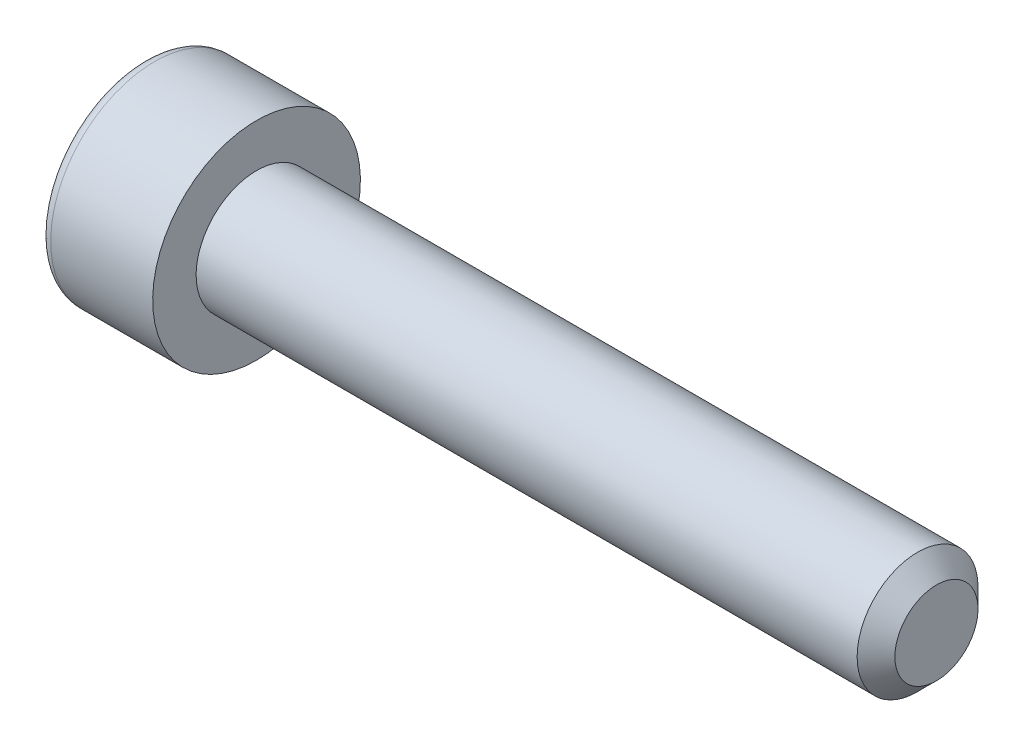
ISO-10303-21;
HEADER;
FILE_DESCRIPTION(('STEP AP214'),'2;1');
FILE_NAME('part.step','',(''),(''),'','','');
FILE_SCHEMA(('AUTOMOTIVE_DESIGN { 1 0 10303 214 1 1 1 1 }'));
ENDSEC;
DATA;
#1=APPLICATION_CONTEXT('core data for automotive mechanical design processes');
#2=APPLICATION_PROTOCOL_DEFINITION('international standard','automotive_design',2000,#1);
#3=PRODUCT_CONTEXT('',#1,'mechanical');
#4=PRODUCT('Part','Part','',(#3));
#5=PRODUCT_RELATED_PRODUCT_CATEGORY('part','',(#4));
#6=PRODUCT_DEFINITION_FORMATION('','',#4);
#7=PRODUCT_DEFINITION_CONTEXT('part definition',#1,'design');
#8=PRODUCT_DEFINITION('design','',#6,#7);
#9=PRODUCT_DEFINITION_SHAPE('','',#8);
#10=(LENGTH_UNIT() NAMED_UNIT(*) SI_UNIT(.MILLI.,.METRE.));
#11=(NAMED_UNIT(*) PLANE_ANGLE_UNIT() SI_UNIT($,.RADIAN.));
#12=(NAMED_UNIT(*) SI_UNIT($,.STERADIAN.) SOLID_ANGLE_UNIT());
#13=UNCERTAINTY_MEASURE_WITH_UNIT(LENGTH_MEASURE(1.E-05),#10,'distance_accuracy_value','');
#14=(GEOMETRIC_REPRESENTATION_CONTEXT(3) GLOBAL_UNCERTAINTY_ASSIGNED_CONTEXT((#13)) GLOBAL_UNIT_ASSIGNED_CONTEXT((#10,
#11,#12)) REPRESENTATION_CONTEXT('',''));
#15=CARTESIAN_POINT('',(0.,0.,0.));
#16=DIRECTION('',(0.,0.,1.));
#17=DIRECTION('',(1.,0.,0.));
#18=AXIS2_PLACEMENT_3D('',#15,#16,#17);
#19=CARTESIAN_POINT('',(-1.70000000002801,0.,0.));
#20=DIRECTION('',(-1.,0.,0.));
#21=DIRECTION('',(0.,0.,1.));
#22=AXIS2_PLACEMENT_3D('',#19,#20,#21);
#23=CONICAL_SURFACE('',#22,1.43650000001117,1.04719755119831);
#24=CARTESIAN_POINT('',(-0.870636338333952,0.,0.));
#25=VERTEX_POINT('',#24);
#26=VERTEX_LOOP('',#25);
#27=FACE_BOUND('',#26,.T.);
#28=CARTESIAN_POINT('',(-1.69999999996238,0.,0.));
#29=DIRECTION('',(-1.,0.,0.));
#30=DIRECTION('',(0.,0.,1.));
#31=AXIS2_PLACEMENT_3D('',#28,#29,#30);
#32=CIRCLE('',#31,1.43649999989748);
#33=CARTESIAN_POINT('',(-1.69999999996238,-0.718249999948738,-1.24404549244756));
#34=VERTEX_POINT('',#33);
#35=CARTESIAN_POINT('',(-1.69999999996238,-1.43649999989748,0.));
#36=VERTEX_POINT('',#35);
#37=EDGE_CURVE('E126',#34,#36,#32,.T.);
#38=ORIENTED_EDGE('',*,*,#37,.T.);
#39=CARTESIAN_POINT('',(-1.70000000002801,0.,0.));
#40=DIRECTION('',(-1.,0.,0.));
#41=DIRECTION('',(0.,0.,1.));
#42=AXIS2_PLACEMENT_3D('',#39,#40,#41);
#43=CIRCLE('',#42,1.43650000001117);
#44=CARTESIAN_POINT('',(-1.70000000002801,-0.718250000005583,1.24404549254602));
#45=VERTEX_POINT('',#44);
#46=EDGE_CURVE('E76',#36,#45,#43,.T.);
#47=ORIENTED_EDGE('',*,*,#46,.T.);
#48=CARTESIAN_POINT('',(-1.70000000002801,0.,0.));
#49=DIRECTION('',(-1.,0.,0.));
#50=DIRECTION('',(0.,0.,1.));
#51=AXIS2_PLACEMENT_3D('',#48,#49,#50);
#52=CIRCLE('',#51,1.43650000001117);
#53=CARTESIAN_POINT('',(-1.70000000002801,0.718250000005582,1.24404549254602));
#54=VERTEX_POINT('',#53);
#55=EDGE_CURVE('E134',#45,#54,#52,.T.);
#56=ORIENTED_EDGE('',*,*,#55,.T.);
#57=CARTESIAN_POINT('',(-1.70000000002801,0.,0.));
#58=DIRECTION('',(-1.,0.,0.));
#59=DIRECTION('',(0.,0.,1.));
#60=AXIS2_PLACEMENT_3D('',#57,#58,#59);
#61=CIRCLE('',#60,1.43650000001116);
#62=CARTESIAN_POINT('',(-1.70000000001401,1.43650000000558,9.66880570697553E-12));
#63=VERTEX_POINT('',#62);
#64=EDGE_CURVE('E132',#54,#63,#61,.T.);
#65=ORIENTED_EDGE('',*,*,#64,.T.);
#66=CARTESIAN_POINT('',(-1.70000000002801,0.,0.));
#67=DIRECTION('',(-1.,0.,0.));
#68=DIRECTION('',(0.,0.,1.));
#69=AXIS2_PLACEMENT_3D('',#66,#67,#68);
#70=CIRCLE('',#69,1.43650000001117);
#71=CARTESIAN_POINT('',(-1.70000000002801,0.718250000005581,-1.24404549254602));
#72=VERTEX_POINT('',#71);
#73=EDGE_CURVE('E130',#63,#72,#70,.T.);
#74=ORIENTED_EDGE('',*,*,#73,.T.);
#75=CARTESIAN_POINT('',(-1.70000000002801,0.,0.));
#76=DIRECTION('',(-1.,0.,0.));
#77=DIRECTION('',(0.,0.,1.));
#78=AXIS2_PLACEMENT_3D('',#75,#76,#77);
#79=CIRCLE('',#78,1.43650000001117);
#80=EDGE_CURVE('E128',#72,#34,#79,.T.);
#81=ORIENTED_EDGE('',*,*,#80,.T.);
#82=EDGE_LOOP('',(#38,#47,#56,#65,#74,#81));
#83=FACE_BOUND('',#82,.T.);
#84=ADVANCED_FACE('F16',(#27,#83),#23,.F.);
#85=CARTESIAN_POINT('',(-1.7,0.,0.));
#86=DIRECTION('',(-1.,0.,0.));
#87=DIRECTION('',(0.,-1.,0.));
#88=AXIS2_PLACEMENT_3D('',#85,#86,#87);
#89=PLANE('',#88);
#90=ORIENTED_EDGE('',*,*,#55,.F.);
#91=DIRECTION('',(0.,1.,0.));
#92=VECTOR('',#91,1.);
#93=CARTESIAN_POINT('',(-1.7,-0.71825,1.24404549253635));
#94=LINE('',#93,#92);
#95=EDGE_CURVE('E90',#45,#54,#94,.T.);
#96=ORIENTED_EDGE('',*,*,#95,.T.);
#97=EDGE_LOOP('',(#90,#96));
#98=FACE_BOUND('',#97,.T.);
#99=ADVANCED_FACE('F199',(#98),#89,.F.);
#100=CARTESIAN_POINT('',(-1.7,0.,0.));
#101=DIRECTION('',(-1.,0.,0.));
#102=DIRECTION('',(0.,-1.,0.));
#103=AXIS2_PLACEMENT_3D('',#100,#101,#102);
#104=PLANE('',#103);
#105=ORIENTED_EDGE('',*,*,#64,.F.);
#106=DIRECTION('',(0.,-0.5,0.866025403784439));
#107=VECTOR('',#106,1.);
#108=CARTESIAN_POINT('',(-1.7,0.71825,1.24404549253635));
#109=LINE('',#108,#107);
#110=EDGE_CURVE('E444',#54,#63,#109,.F.);
#111=ORIENTED_EDGE('',*,*,#110,.T.);
#112=EDGE_LOOP('',(#105,#111));
#113=FACE_BOUND('',#112,.T.);
#114=ADVANCED_FACE('F196',(#113),#104,.F.);
#115=CARTESIAN_POINT('',(-1.7,0.,0.));
#116=DIRECTION('',(-1.,0.,0.));
#117=DIRECTION('',(0.,-1.,0.));
#118=AXIS2_PLACEMENT_3D('',#115,#116,#117);
#119=PLANE('',#118);
#120=ORIENTED_EDGE('',*,*,#73,.F.);
#121=DIRECTION('',(0.,0.5,0.866025403784439));
#122=VECTOR('',#121,1.);
#123=CARTESIAN_POINT('',(-1.7,1.4365,0.));
#124=LINE('',#123,#122);
#125=EDGE_CURVE('E433',#63,#72,#124,.F.);
#126=ORIENTED_EDGE('',*,*,#125,.T.);
#127=EDGE_LOOP('',(#120,#126));
#128=FACE_BOUND('',#127,.T.);
#129=ADVANCED_FACE('F192',(#128),#119,.F.);
#130=CARTESIAN_POINT('',(-1.7,0.,0.));
#131=DIRECTION('',(-1.,0.,0.));
#132=DIRECTION('',(0.,-1.,0.));
#133=AXIS2_PLACEMENT_3D('',#130,#131,#132);
#134=PLANE('',#133);
#135=ORIENTED_EDGE('',*,*,#80,.F.);
#136=DIRECTION('',(0.,1.,0.));
#137=VECTOR('',#136,1.);
#138=CARTESIAN_POINT('',(-1.7,0.71825,-1.24404549253635));
#139=LINE('',#138,#137);
#140=EDGE_CURVE('E422',#72,#34,#139,.F.);
#141=ORIENTED_EDGE('',*,*,#140,.T.);
#142=EDGE_LOOP('',(#135,#141));
#143=FACE_BOUND('',#142,.T.);
#144=ADVANCED_FACE('F188',(#143),#134,.F.);
#145=CARTESIAN_POINT('',(-1.7,0.,0.));
#146=DIRECTION('',(-1.,0.,0.));
#147=DIRECTION('',(0.,-1.,0.));
#148=AXIS2_PLACEMENT_3D('',#145,#146,#147);
#149=PLANE('',#148);
#150=ORIENTED_EDGE('',*,*,#37,.F.);
#151=DIRECTION('',(0.,0.499999999999999,-0.866025403784439));
#152=VECTOR('',#151,1.);
#153=CARTESIAN_POINT('',(-1.7,-0.71825,-1.24404549253635));
#154=LINE('',#153,#152);
#155=EDGE_CURVE('E404',#34,#36,#154,.F.);
#156=ORIENTED_EDGE('',*,*,#155,.T.);
#157=EDGE_LOOP('',(#150,#156));
#158=FACE_BOUND('',#157,.T.);
#159=ADVANCED_FACE('F184',(#158),#149,.F.);
#160=CARTESIAN_POINT('',(-1.7,0.,0.));
#161=DIRECTION('',(-1.,0.,0.));
#162=DIRECTION('',(0.,-1.,0.));
#163=AXIS2_PLACEMENT_3D('',#160,#161,#162);
#164=PLANE('',#163);
#165=ORIENTED_EDGE('',*,*,#46,.F.);
#166=DIRECTION('',(0.,-0.5,-0.866025403784439));
#167=VECTOR('',#166,1.);
#168=CARTESIAN_POINT('',(-1.7,-1.4365,0.));
#169=LINE('',#168,#167);
#170=EDGE_CURVE('E93',#36,#45,#169,.F.);
#171=ORIENTED_EDGE('',*,*,#170,.T.);
#172=EDGE_LOOP('',(#165,#171));
#173=FACE_BOUND('',#172,.T.);
#174=ADVANCED_FACE('F181',(#173),#164,.F.);
#175=CARTESIAN_POINT('',(-1.7,-0.71825,1.24404549253635));
#176=DIRECTION('',(0.,0.,1.));
#177=DIRECTION('',(1.,0.,0.));
#178=AXIS2_PLACEMENT_3D('',#175,#176,#177);
#179=PLANE('',#178);
#180=DIRECTION('',(1.,0.,0.));
#181=VECTOR('',#180,1.);
#182=CARTESIAN_POINT('',(-1.7,0.71825,1.24404549253635));
#183=LINE('',#182,#181);
#184=CARTESIAN_POINT('',(-3.,0.71825,1.24404549253635));
#185=VERTEX_POINT('',#184);
#186=EDGE_CURVE('E409',#185,#54,#183,.T.);
#187=ORIENTED_EDGE('',*,*,#186,.T.);
#188=ORIENTED_EDGE('',*,*,#95,.F.);
#189=DIRECTION('',(1.,0.,0.));
#190=VECTOR('',#189,1.);
#191=CARTESIAN_POINT('',(-1.7,-0.718250000000002,1.24404549253635));
#192=LINE('',#191,#190);
#193=CARTESIAN_POINT('',(-3.,-0.718250000000001,1.24404549253635));
#194=VERTEX_POINT('',#193);
#195=EDGE_CURVE('E82',#45,#194,#192,.F.);
#196=ORIENTED_EDGE('',*,*,#195,.T.);
#197=DIRECTION('',(0.,1.,0.));
#198=VECTOR('',#197,1.);
#199=CARTESIAN_POINT('',(-3.,1.4365,1.24404549253635));
#200=LINE('',#199,#198);
#201=EDGE_CURVE('E87',#194,#185,#200,.T.);
#202=ORIENTED_EDGE('',*,*,#201,.T.);
#203=EDGE_LOOP('',(#187,#188,#196,#202));
#204=FACE_BOUND('',#203,.T.);
#205=ADVANCED_FACE('F85',(#204),#179,.F.);
#206=CARTESIAN_POINT('',(-1.7,0.71825,1.24404549253635));
#207=DIRECTION('',(0.,0.866025403784439,0.5));
#208=DIRECTION('',(0.,-0.5,0.866025403784439));
#209=AXIS2_PLACEMENT_3D('',#206,#207,#208);
#210=PLANE('',#209);
#211=DIRECTION('',(1.,0.,0.));
#212=VECTOR('',#211,1.);
#213=CARTESIAN_POINT('',(-1.7,1.4365,0.));
#214=LINE('',#213,#212);
#215=CARTESIAN_POINT('',(-3.,1.4365,0.));
#216=VERTEX_POINT('',#215);
#217=EDGE_CURVE('E438',#216,#63,#214,.T.);
#218=ORIENTED_EDGE('',*,*,#217,.T.);
#219=ORIENTED_EDGE('',*,*,#110,.F.);
#220=ORIENTED_EDGE('',*,*,#186,.F.);
#221=DIRECTION('',(0.,0.499999999999999,-0.866025403784439));
#222=VECTOR('',#221,1.);
#223=CARTESIAN_POINT('',(-3.,0.71825,1.24404549253635));
#224=LINE('',#223,#222);
#225=EDGE_CURVE('E108',#185,#216,#224,.T.);
#226=ORIENTED_EDGE('',*,*,#225,.T.);
#227=EDGE_LOOP('',(#218,#219,#220,#226));
#228=FACE_BOUND('',#227,.T.);
#229=ADVANCED_FACE('F174',(#228),#210,.F.);
#230=CARTESIAN_POINT('',(-1.7,1.4365,0.));
#231=DIRECTION('',(0.,0.866025403784439,-0.5));
#232=DIRECTION('',(0.,0.5,0.866025403784439));
#233=AXIS2_PLACEMENT_3D('',#230,#231,#232);
#234=PLANE('',#233);
#235=DIRECTION('',(-1.,0.,0.));
#236=VECTOR('',#235,1.);
#237=CARTESIAN_POINT('',(-1.7,0.71825,-1.24404549253635));
#238=LINE('',#237,#236);
#239=CARTESIAN_POINT('',(-3.,0.71825,-1.24404549253635));
#240=VERTEX_POINT('',#239);
#241=EDGE_CURVE('E427',#240,#72,#238,.F.);
#242=ORIENTED_EDGE('',*,*,#241,.T.);
#243=ORIENTED_EDGE('',*,*,#125,.F.);
#244=ORIENTED_EDGE('',*,*,#217,.F.);
#245=DIRECTION('',(0.,-0.500000000000001,-0.866025403784438));
#246=VECTOR('',#245,1.);
#247=CARTESIAN_POINT('',(-3.,1.4365,0.));
#248=LINE('',#247,#246);
#249=EDGE_CURVE('E110',#216,#240,#248,.T.);
#250=ORIENTED_EDGE('',*,*,#249,.T.);
#251=EDGE_LOOP('',(#242,#243,#244,#250));
#252=FACE_BOUND('',#251,.T.);
#253=ADVANCED_FACE('F170',(#252),#234,.F.);
#254=CARTESIAN_POINT('',(-1.7,0.71825,-1.24404549253635));
#255=DIRECTION('',(0.,0.,-1.));
#256=DIRECTION('',(-1.,0.,0.));
#257=AXIS2_PLACEMENT_3D('',#254,#255,#256);
#258=PLANE('',#257);
#259=DIRECTION('',(1.,0.,0.));
#260=VECTOR('',#259,1.);
#261=CARTESIAN_POINT('',(-1.7,-0.71825,-1.24404549253635));
#262=LINE('',#261,#260);
#263=CARTESIAN_POINT('',(-3.,-0.71825,-1.24404549253635));
#264=VERTEX_POINT('',#263);
#265=EDGE_CURVE('E413',#264,#34,#262,.T.);
#266=ORIENTED_EDGE('',*,*,#265,.T.);
#267=ORIENTED_EDGE('',*,*,#140,.F.);
#268=ORIENTED_EDGE('',*,*,#241,.F.);
#269=DIRECTION('',(0.,1.,0.));
#270=VECTOR('',#269,1.);
#271=CARTESIAN_POINT('',(-3.,1.4365,-1.24404549253634));
#272=LINE('',#271,#270);
#273=EDGE_CURVE('E415',#240,#264,#272,.F.);
#274=ORIENTED_EDGE('',*,*,#273,.T.);
#275=EDGE_LOOP('',(#266,#267,#268,#274));
#276=FACE_BOUND('',#275,.T.);
#277=ADVANCED_FACE('F166',(#276),#258,.F.);
#278=CARTESIAN_POINT('',(-1.7,-0.71825,-1.24404549253635));
#279=DIRECTION('',(0.,-0.866025403784439,-0.499999999999999));
#280=DIRECTION('',(0.,0.499999999999999,-0.866025403784439));
#281=AXIS2_PLACEMENT_3D('',#278,#279,#280);
#282=PLANE('',#281);
#283=DIRECTION('',(1.,0.,0.));
#284=VECTOR('',#283,1.);
#285=CARTESIAN_POINT('',(-1.7,-1.4365,0.));
#286=LINE('',#285,#284);
#287=CARTESIAN_POINT('',(-3.,-1.4365,0.));
#288=VERTEX_POINT('',#287);
#289=EDGE_CURVE('E100',#288,#36,#286,.T.);
#290=ORIENTED_EDGE('',*,*,#289,.T.);
#291=ORIENTED_EDGE('',*,*,#155,.F.);
#292=ORIENTED_EDGE('',*,*,#265,.F.);
#293=DIRECTION('',(0.,-0.499999999999999,0.866025403784439));
#294=VECTOR('',#293,1.);
#295=CARTESIAN_POINT('',(-3.,-0.71825,-1.24404549253635));
#296=LINE('',#295,#294);
#297=EDGE_CURVE('E103',#264,#288,#296,.T.);
#298=ORIENTED_EDGE('',*,*,#297,.T.);
#299=EDGE_LOOP('',(#290,#291,#292,#298));
#300=FACE_BOUND('',#299,.T.);
#301=ADVANCED_FACE('F163',(#300),#282,.F.);
#302=CARTESIAN_POINT('',(-1.7,-1.4365,0.));
#303=DIRECTION('',(0.,-0.866025403784439,0.5));
#304=DIRECTION('',(0.,-0.5,-0.866025403784439));
#305=AXIS2_PLACEMENT_3D('',#302,#303,#304);
#306=PLANE('',#305);
#307=ORIENTED_EDGE('',*,*,#195,.F.);
#308=ORIENTED_EDGE('',*,*,#170,.F.);
#309=ORIENTED_EDGE('',*,*,#289,.F.);
#310=DIRECTION('',(0.,0.499999999999999,0.866025403784439));
#311=VECTOR('',#310,1.);
#312=CARTESIAN_POINT('',(-3.,-1.4365,0.));
#313=LINE('',#312,#311);
#314=EDGE_CURVE('E97',#288,#194,#313,.T.);
#315=ORIENTED_EDGE('',*,*,#314,.T.);
#316=EDGE_LOOP('',(#307,#308,#309,#315));
#317=FACE_BOUND('',#316,.T.);
#318=ADVANCED_FACE('F98',(#317),#306,.F.);
#319=CARTESIAN_POINT('',(-3.,1.4365,0.));
#320=DIRECTION('',(1.,0.,0.));
#321=DIRECTION('',(0.,1.,0.));
#322=AXIS2_PLACEMENT_3D('',#319,#320,#321);
#323=PLANE('',#322);
#324=CARTESIAN_POINT('',(-3.,0.,0.));
#325=DIRECTION('',(1.,0.,0.));
#326=DIRECTION('',(0.,-1.,0.));
#327=AXIS2_PLACEMENT_3D('',#324,#325,#326);
#328=CIRCLE('',#327,2.45);
#329=CARTESIAN_POINT('',(-3.,-2.45,0.));
#330=VERTEX_POINT('',#329);
#331=CARTESIAN_POINT('',(-3.,2.45,0.));
#332=VERTEX_POINT('',#331);
#333=EDGE_CURVE('E35',#330,#332,#328,.T.);
#334=ORIENTED_EDGE('',*,*,#333,.F.);
#335=CARTESIAN_POINT('',(-3.,0.,0.));
#336=DIRECTION('',(1.,0.,0.));
#337=DIRECTION('',(0.,1.,0.));
#338=AXIS2_PLACEMENT_3D('',#335,#336,#337);
#339=CIRCLE('',#338,2.45);
#340=EDGE_CURVE('E138',#332,#330,#339,.T.);
#341=ORIENTED_EDGE('',*,*,#340,.F.);
#342=EDGE_LOOP('',(#334,#341));
#343=FACE_BOUND('',#342,.T.);
#344=ORIENTED_EDGE('',*,*,#297,.F.);
#345=ORIENTED_EDGE('',*,*,#273,.F.);
#346=ORIENTED_EDGE('',*,*,#249,.F.);
#347=ORIENTED_EDGE('',*,*,#225,.F.);
#348=ORIENTED_EDGE('',*,*,#201,.F.);
#349=ORIENTED_EDGE('',*,*,#314,.F.);
#350=EDGE_LOOP('',(#344,#345,#346,#347,#348,#349));
#351=FACE_BOUND('',#350,.T.);
#352=ADVANCED_FACE('F106',(#343,#351),#323,.F.);
#353=CARTESIAN_POINT('',(-2.7,0.,0.));
#354=DIRECTION('',(-1.,0.,0.));
#355=DIRECTION('',(0.,1.,0.));
#356=AXIS2_PLACEMENT_3D('',#353,#354,#355);
#357=TOROIDAL_SURFACE('',#356,2.45,0.3);
#358=ORIENTED_EDGE('',*,*,#333,.T.);
#359=ORIENTED_EDGE('',*,*,#340,.T.);
#360=EDGE_LOOP('',(#358,#359));
#361=FACE_BOUND('',#360,.T.);
#362=CARTESIAN_POINT('',(-2.7,0.,0.));
#363=DIRECTION('',(-1.,0.,0.));
#364=DIRECTION('',(0.,-1.,0.));
#365=AXIS2_PLACEMENT_3D('',#362,#363,#364);
#366=CIRCLE('',#365,2.75);
#367=CARTESIAN_POINT('',(-2.7,-2.75,0.));
#368=VERTEX_POINT('',#367);
#369=EDGE_CURVE('E124',#368,#368,#366,.F.);
#370=ORIENTED_EDGE('',*,*,#369,.F.);
#371=EDGE_LOOP('',(#370));
#372=FACE_BOUND('',#371,.T.);
#373=ADVANCED_FACE('F136',(#361,#372),#357,.T.);
#374=CARTESIAN_POINT('',(18.,0.,0.));
#375=DIRECTION('',(1.,0.,0.));
#376=DIRECTION('',(0.,0.,-1.));
#377=AXIS2_PLACEMENT_3D('',#374,#375,#376);
#378=PLANE('',#377);
#379=CARTESIAN_POINT('',(17.9999999999723,0.,0.));
#380=DIRECTION('',(-1.,0.,0.));
#381=DIRECTION('',(0.,0.,1.));
#382=AXIS2_PLACEMENT_3D('',#379,#380,#381);
#383=CIRCLE('',#382,1.1000000000081);
#384=CARTESIAN_POINT('',(17.9999999999723,0.,1.1000000000081));
#385=VERTEX_POINT('',#384);
#386=EDGE_CURVE('E121',#385,#385,#383,.T.);
#387=ORIENTED_EDGE('',*,*,#386,.F.);
#388=EDGE_LOOP('',(#387));
#389=FACE_BOUND('',#388,.T.);
#390=ADVANCED_FACE('F226',(#389),#378,.T.);
#391=CARTESIAN_POINT('',(-0.870636338309101,0.,0.));
#392=DIRECTION('',(-1.,0.,0.));
#393=DIRECTION('',(0.,-1.,0.));
#394=AXIS2_PLACEMENT_3D('',#391,#392,#393);
#395=CYLINDRICAL_SURFACE('',#394,2.75);
#396=ORIENTED_EDGE('',*,*,#369,.T.);
#397=EDGE_LOOP('',(#396));
#398=FACE_BOUND('',#397,.T.);
#399=CARTESIAN_POINT('',(0.,0.,0.));
#400=DIRECTION('',(-1.,0.,0.));
#401=DIRECTION('',(0.,-1.,0.));
#402=AXIS2_PLACEMENT_3D('',#399,#400,#401);
#403=CIRCLE('',#402,2.75);
#404=CARTESIAN_POINT('',(0.,-2.75,0.));
#405=VERTEX_POINT('',#404);
#406=EDGE_CURVE('E118',#405,#405,#403,.T.);
#407=ORIENTED_EDGE('',*,*,#406,.T.);
#408=EDGE_LOOP('',(#407));
#409=FACE_BOUND('',#408,.T.);
#410=ADVANCED_FACE('F223',(#398,#409),#395,.T.);
#411=CARTESIAN_POINT('',(17.4999999999841,0.,0.));
#412=DIRECTION('',(-1.,0.,0.));
#413=DIRECTION('',(0.,0.,1.));
#414=AXIS2_PLACEMENT_3D('',#411,#412,#413);
#415=CONICAL_SURFACE('',#414,1.59999999999627,0.785398163397448);
#416=CARTESIAN_POINT('',(17.5,0.,0.));
#417=DIRECTION('',(-1.,0.,0.));
#418=DIRECTION('',(0.,-1.,0.));
#419=AXIS2_PLACEMENT_3D('',#416,#417,#418);
#420=CIRCLE('',#419,1.6);
#421=CARTESIAN_POINT('',(17.5,-1.6,0.));
#422=VERTEX_POINT('',#421);
#423=EDGE_CURVE('E27',#422,#422,#420,.T.);
#424=ORIENTED_EDGE('',*,*,#423,.F.);
#425=EDGE_LOOP('',(#424));
#426=FACE_BOUND('',#425,.T.);
#427=ORIENTED_EDGE('',*,*,#386,.T.);
#428=EDGE_LOOP('',(#427));
#429=FACE_BOUND('',#428,.T.);
#430=ADVANCED_FACE('F216',(#426,#429),#415,.T.);
#431=CARTESIAN_POINT('',(0.,2.75,0.));
#432=DIRECTION('',(-1.,0.,0.));
#433=DIRECTION('',(0.,-1.,0.));
#434=AXIS2_PLACEMENT_3D('',#431,#432,#433);
#435=PLANE('',#434);
#436=CARTESIAN_POINT('',(0.,0.,0.));
#437=DIRECTION('',(-1.,0.,0.));
#438=DIRECTION('',(0.,-1.,0.));
#439=AXIS2_PLACEMENT_3D('',#436,#437,#438);
#440=CIRCLE('',#439,1.6);
#441=CARTESIAN_POINT('',(0.,-1.6,0.));
#442=VERTEX_POINT('',#441);
#443=EDGE_CURVE('E11',#442,#442,#440,.F.);
#444=ORIENTED_EDGE('',*,*,#443,.F.);
#445=EDGE_LOOP('',(#444));
#446=FACE_BOUND('',#445,.T.);
#447=ORIENTED_EDGE('',*,*,#406,.F.);
#448=EDGE_LOOP('',(#447));
#449=FACE_BOUND('',#448,.T.);
#450=ADVANCED_FACE('F210',(#446,#449),#435,.F.);
#451=CARTESIAN_POINT('',(16.,0.,0.));
#452=DIRECTION('',(-1.,0.,0.));
#453=DIRECTION('',(0.,-1.,0.));
#454=AXIS2_PLACEMENT_3D('',#451,#452,#453);
#455=CYLINDRICAL_SURFACE('',#454,1.6);
#456=ORIENTED_EDGE('',*,*,#443,.T.);
#457=EDGE_LOOP('',(#456));
#458=FACE_BOUND('',#457,.T.);
#459=ORIENTED_EDGE('',*,*,#423,.T.);
#460=EDGE_LOOP('',(#459));
#461=FACE_BOUND('',#460,.T.);
#462=ADVANCED_FACE('F208',(#458,#461),#455,.T.);
#463=CLOSED_SHELL('',(#84,#99,#114,#129,#144,#159,#174,#205,#229,#253,#277,#301,#318,#352,#373,
#390,#410,#430,#450,#462));
#464=MANIFOLD_SOLID_BREP('B1',#463);
#465=ADVANCED_BREP_SHAPE_REPRESENTATION('',(#18,#464),#14);
#466=SHAPE_DEFINITION_REPRESENTATION(#9,#465);
ENDSEC;
END-ISO-10303-21;
